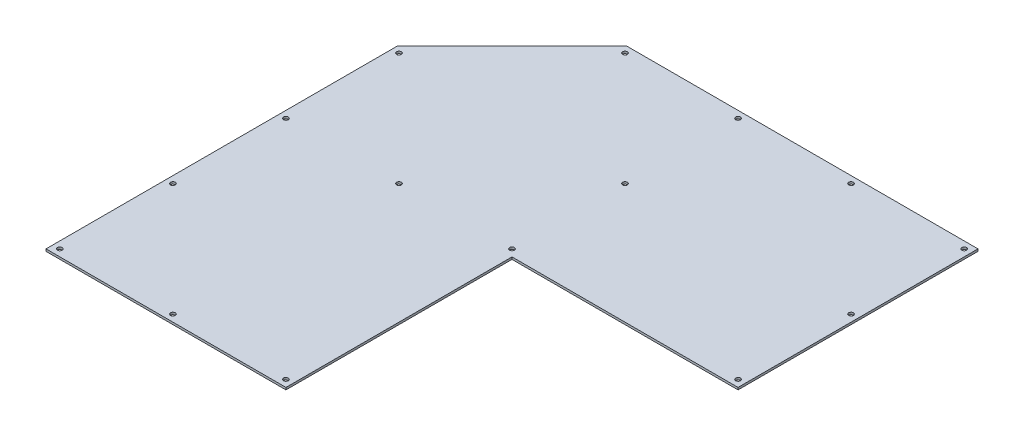
ISO-10303-21;
HEADER;
FILE_DESCRIPTION(('STEP AP214'),'2;1');
FILE_NAME('part.step','',(''),(''),'','','');
FILE_SCHEMA(('AUTOMOTIVE_DESIGN { 1 0 10303 214 1 1 1 1 }'));
ENDSEC;
DATA;
#1=APPLICATION_CONTEXT('core data for automotive mechanical design processes');
#2=APPLICATION_PROTOCOL_DEFINITION('international standard','automotive_design',2000,#1);
#3=PRODUCT_CONTEXT('',#1,'mechanical');
#4=PRODUCT('Part','Part','',(#3));
#5=PRODUCT_RELATED_PRODUCT_CATEGORY('part','',(#4));
#6=PRODUCT_DEFINITION_FORMATION('','',#4);
#7=PRODUCT_DEFINITION_CONTEXT('part definition',#1,'design');
#8=PRODUCT_DEFINITION('design','',#6,#7);
#9=PRODUCT_DEFINITION_SHAPE('','',#8);
#10=(LENGTH_UNIT() NAMED_UNIT(*) SI_UNIT(.MILLI.,.METRE.));
#11=(NAMED_UNIT(*) PLANE_ANGLE_UNIT() SI_UNIT($,.RADIAN.));
#12=(NAMED_UNIT(*) SI_UNIT($,.STERADIAN.) SOLID_ANGLE_UNIT());
#13=UNCERTAINTY_MEASURE_WITH_UNIT(LENGTH_MEASURE(1.E-05),#10,'distance_accuracy_value','');
#14=(GEOMETRIC_REPRESENTATION_CONTEXT(3) GLOBAL_UNCERTAINTY_ASSIGNED_CONTEXT((#13)) GLOBAL_UNIT_ASSIGNED_CONTEXT((#10,
#11,#12)) REPRESENTATION_CONTEXT('',''));
#15=CARTESIAN_POINT('',(0.,0.,0.));
#16=DIRECTION('',(0.,0.,1.));
#17=DIRECTION('',(1.,0.,0.));
#18=AXIS2_PLACEMENT_3D('',#15,#16,#17);
#19=CARTESIAN_POINT('',(175.26,-1.5875,0.));
#20=DIRECTION('',(0.,0.,1.));
#21=DIRECTION('',(1.,0.,0.));
#22=AXIS2_PLACEMENT_3D('',#19,#20,#21);
#23=PLANE('',#22);
#24=DIRECTION('',(1.,0.,0.));
#25=VECTOR('',#24,1.);
#26=CARTESIAN_POINT('',(175.26,0.,0.));
#27=LINE('',#26,#25);
#28=CARTESIAN_POINT('',(0.,0.,0.));
#29=VERTEX_POINT('',#28);
#30=CARTESIAN_POINT('',(175.26,0.,0.));
#31=VERTEX_POINT('',#30);
#32=EDGE_CURVE('E130',#29,#31,#27,.T.);
#33=ORIENTED_EDGE('',*,*,#32,.F.);
#34=DIRECTION('',(0.,1.,0.));
#35=VECTOR('',#34,1.);
#36=CARTESIAN_POINT('',(0.,-1.5875,0.));
#37=LINE('',#36,#35);
#38=CARTESIAN_POINT('',(0.,-1.5875,0.));
#39=VERTEX_POINT('',#38);
#40=EDGE_CURVE('E11',#39,#29,#37,.T.);
#41=ORIENTED_EDGE('',*,*,#40,.F.);
#42=DIRECTION('',(1.,0.,0.));
#43=VECTOR('',#42,1.);
#44=CARTESIAN_POINT('',(175.26,-1.5875,0.));
#45=LINE('',#44,#43);
#46=CARTESIAN_POINT('',(175.26,-1.5875,0.));
#47=VERTEX_POINT('',#46);
#48=EDGE_CURVE('E148',#39,#47,#45,.T.);
#49=ORIENTED_EDGE('',*,*,#48,.T.);
#50=DIRECTION('',(0.,1.,0.));
#51=VECTOR('',#50,1.);
#52=CARTESIAN_POINT('',(175.26,-1.5875,0.));
#53=LINE('',#52,#51);
#54=EDGE_CURVE('E42',#47,#31,#53,.T.);
#55=ORIENTED_EDGE('',*,*,#54,.T.);
#56=EDGE_LOOP('',(#33,#41,#49,#55));
#57=FACE_BOUND('',#56,.T.);
#58=ADVANCED_FACE('F39',(#57),#23,.T.);
#59=CARTESIAN_POINT('',(0.,-1.5875,0.));
#60=DIRECTION('',(-1.,0.,0.));
#61=DIRECTION('',(0.,0.,1.));
#62=AXIS2_PLACEMENT_3D('',#59,#60,#61);
#63=PLANE('',#62);
#64=DIRECTION('',(0.,0.,1.));
#65=VECTOR('',#64,1.);
#66=CARTESIAN_POINT('',(0.,0.,0.));
#67=LINE('',#66,#65);
#68=CARTESIAN_POINT('',(0.,0.,-256.54));
#69=VERTEX_POINT('',#68);
#70=EDGE_CURVE('E146',#69,#29,#67,.T.);
#71=ORIENTED_EDGE('',*,*,#70,.F.);
#72=DIRECTION('',(0.,1.,0.));
#73=VECTOR('',#72,1.);
#74=CARTESIAN_POINT('',(0.,-1.5875,-256.54));
#75=LINE('',#74,#73);
#76=CARTESIAN_POINT('',(0.,-1.5875,-256.54));
#77=VERTEX_POINT('',#76);
#78=EDGE_CURVE('E48',#77,#69,#75,.T.);
#79=ORIENTED_EDGE('',*,*,#78,.F.);
#80=DIRECTION('',(0.,0.,1.));
#81=VECTOR('',#80,1.);
#82=CARTESIAN_POINT('',(0.,-1.5875,0.));
#83=LINE('',#82,#81);
#84=EDGE_CURVE('E120',#77,#39,#83,.T.);
#85=ORIENTED_EDGE('',*,*,#84,.T.);
#86=ORIENTED_EDGE('',*,*,#40,.T.);
#87=EDGE_LOOP('',(#71,#79,#85,#86));
#88=FACE_BOUND('',#87,.T.);
#89=ADVANCED_FACE('F158',(#88),#63,.T.);
#90=CARTESIAN_POINT('',(0.,-1.5875,-256.54));
#91=DIRECTION('',(-0.707106781186548,0.,-0.707106781186548));
#92=DIRECTION('',(-0.707106781186548,0.,0.707106781186548));
#93=AXIS2_PLACEMENT_3D('',#90,#91,#92);
#94=PLANE('',#93);
#95=DIRECTION('',(-0.707106781186548,0.,0.707106781186548));
#96=VECTOR('',#95,1.);
#97=CARTESIAN_POINT('',(0.,0.,-256.54));
#98=LINE('',#97,#96);
#99=CARTESIAN_POINT('',(83.82,0.,-340.36));
#100=VERTEX_POINT('',#99);
#101=EDGE_CURVE('E107',#100,#69,#98,.T.);
#102=ORIENTED_EDGE('',*,*,#101,.F.);
#103=DIRECTION('',(0.,1.,0.));
#104=VECTOR('',#103,1.);
#105=CARTESIAN_POINT('',(83.82,-1.5875,-340.36));
#106=LINE('',#105,#104);
#107=CARTESIAN_POINT('',(83.82,-1.5875,-340.36));
#108=VERTEX_POINT('',#107);
#109=EDGE_CURVE('E102',#108,#100,#106,.T.);
#110=ORIENTED_EDGE('',*,*,#109,.F.);
#111=DIRECTION('',(-0.707106781186548,0.,0.707106781186548));
#112=VECTOR('',#111,1.);
#113=CARTESIAN_POINT('',(0.,-1.5875,-256.54));
#114=LINE('',#113,#112);
#115=EDGE_CURVE('E105',#108,#77,#114,.T.);
#116=ORIENTED_EDGE('',*,*,#115,.T.);
#117=ORIENTED_EDGE('',*,*,#78,.T.);
#118=EDGE_LOOP('',(#102,#110,#116,#117));
#119=FACE_BOUND('',#118,.T.);
#120=ADVANCED_FACE('F104',(#119),#94,.T.);
#121=CARTESIAN_POINT('',(83.82,-1.5875,-340.36));
#122=DIRECTION('',(0.,0.,-1.));
#123=DIRECTION('',(-1.,0.,0.));
#124=AXIS2_PLACEMENT_3D('',#121,#122,#123);
#125=PLANE('',#124);
#126=DIRECTION('',(-1.,0.,0.));
#127=VECTOR('',#126,1.);
#128=CARTESIAN_POINT('',(83.82,0.,-340.36));
#129=LINE('',#128,#127);
#130=CARTESIAN_POINT('',(340.36,0.,-340.36));
#131=VERTEX_POINT('',#130);
#132=EDGE_CURVE('E143',#131,#100,#129,.T.);
#133=ORIENTED_EDGE('',*,*,#132,.F.);
#134=DIRECTION('',(0.,1.,0.));
#135=VECTOR('',#134,1.);
#136=CARTESIAN_POINT('',(340.36,-1.5875,-340.36));
#137=LINE('',#136,#135);
#138=CARTESIAN_POINT('',(340.36,-1.5875,-340.36));
#139=VERTEX_POINT('',#138);
#140=EDGE_CURVE('E112',#139,#131,#137,.T.);
#141=ORIENTED_EDGE('',*,*,#140,.F.);
#142=DIRECTION('',(-1.,0.,0.));
#143=VECTOR('',#142,1.);
#144=CARTESIAN_POINT('',(83.82,-1.5875,-340.36));
#145=LINE('',#144,#143);
#146=EDGE_CURVE('E118',#139,#108,#145,.T.);
#147=ORIENTED_EDGE('',*,*,#146,.T.);
#148=ORIENTED_EDGE('',*,*,#109,.T.);
#149=EDGE_LOOP('',(#133,#141,#147,#148));
#150=FACE_BOUND('',#149,.T.);
#151=ADVANCED_FACE('F122',(#150),#125,.T.);
#152=CARTESIAN_POINT('',(340.36,-1.5875,-340.36));
#153=DIRECTION('',(1.,0.,0.));
#154=DIRECTION('',(0.,0.,-1.));
#155=AXIS2_PLACEMENT_3D('',#152,#153,#154);
#156=PLANE('',#155);
#157=DIRECTION('',(0.,0.,-1.));
#158=VECTOR('',#157,1.);
#159=CARTESIAN_POINT('',(340.36,0.,-340.36));
#160=LINE('',#159,#158);
#161=CARTESIAN_POINT('',(340.36,0.,-165.1));
#162=VERTEX_POINT('',#161);
#163=EDGE_CURVE('E140',#162,#131,#160,.T.);
#164=ORIENTED_EDGE('',*,*,#163,.F.);
#165=DIRECTION('',(0.,1.,0.));
#166=VECTOR('',#165,1.);
#167=CARTESIAN_POINT('',(340.36,-1.5875,-165.1));
#168=LINE('',#167,#166);
#169=CARTESIAN_POINT('',(340.36,-1.5875,-165.1));
#170=VERTEX_POINT('',#169);
#171=EDGE_CURVE('E152',#170,#162,#168,.T.);
#172=ORIENTED_EDGE('',*,*,#171,.F.);
#173=DIRECTION('',(0.,0.,-1.));
#174=VECTOR('',#173,1.);
#175=CARTESIAN_POINT('',(340.36,-1.5875,-340.36));
#176=LINE('',#175,#174);
#177=EDGE_CURVE('E123',#170,#139,#176,.T.);
#178=ORIENTED_EDGE('',*,*,#177,.T.);
#179=ORIENTED_EDGE('',*,*,#140,.T.);
#180=EDGE_LOOP('',(#164,#172,#178,#179));
#181=FACE_BOUND('',#180,.T.);
#182=ADVANCED_FACE('F171',(#181),#156,.T.);
#183=CARTESIAN_POINT('',(340.36,-1.5875,-165.1));
#184=DIRECTION('',(0.,0.,1.));
#185=DIRECTION('',(1.,0.,0.));
#186=AXIS2_PLACEMENT_3D('',#183,#184,#185);
#187=PLANE('',#186);
#188=DIRECTION('',(1.,0.,0.));
#189=VECTOR('',#188,1.);
#190=CARTESIAN_POINT('',(340.36,0.,-165.1));
#191=LINE('',#190,#189);
#192=CARTESIAN_POINT('',(175.26,0.,-165.1));
#193=VERTEX_POINT('',#192);
#194=EDGE_CURVE('E137',#193,#162,#191,.T.);
#195=ORIENTED_EDGE('',*,*,#194,.F.);
#196=DIRECTION('',(0.,1.,0.));
#197=VECTOR('',#196,1.);
#198=CARTESIAN_POINT('',(175.26,-1.5875,-165.1));
#199=LINE('',#198,#197);
#200=CARTESIAN_POINT('',(175.26,-1.5875,-165.1));
#201=VERTEX_POINT('',#200);
#202=EDGE_CURVE('E153',#201,#193,#199,.T.);
#203=ORIENTED_EDGE('',*,*,#202,.F.);
#204=DIRECTION('',(1.,0.,0.));
#205=VECTOR('',#204,1.);
#206=CARTESIAN_POINT('',(340.36,-1.5875,-165.1));
#207=LINE('',#206,#205);
#208=EDGE_CURVE('E125',#201,#170,#207,.T.);
#209=ORIENTED_EDGE('',*,*,#208,.T.);
#210=ORIENTED_EDGE('',*,*,#171,.T.);
#211=EDGE_LOOP('',(#195,#203,#209,#210));
#212=FACE_BOUND('',#211,.T.);
#213=ADVANCED_FACE('F174',(#212),#187,.T.);
#214=CARTESIAN_POINT('',(175.26,-1.5875,-165.1));
#215=DIRECTION('',(1.,0.,0.));
#216=DIRECTION('',(0.,0.,-1.));
#217=AXIS2_PLACEMENT_3D('',#214,#215,#216);
#218=PLANE('',#217);
#219=DIRECTION('',(0.,0.,-1.));
#220=VECTOR('',#219,1.);
#221=CARTESIAN_POINT('',(175.26,0.,-165.1));
#222=LINE('',#221,#220);
#223=EDGE_CURVE('E133',#31,#193,#222,.T.);
#224=ORIENTED_EDGE('',*,*,#223,.F.);
#225=ORIENTED_EDGE('',*,*,#54,.F.);
#226=DIRECTION('',(0.,0.,-1.));
#227=VECTOR('',#226,1.);
#228=CARTESIAN_POINT('',(175.26,-1.5875,-165.1));
#229=LINE('',#228,#227);
#230=EDGE_CURVE('E344',#47,#201,#229,.T.);
#231=ORIENTED_EDGE('',*,*,#230,.T.);
#232=ORIENTED_EDGE('',*,*,#202,.T.);
#233=EDGE_LOOP('',(#224,#225,#231,#232));
#234=FACE_BOUND('',#233,.T.);
#235=ADVANCED_FACE('F155',(#234),#218,.T.);
#236=CARTESIAN_POINT('',(0.,-1.5875,0.));
#237=DIRECTION('',(0.,-1.,0.));
#238=DIRECTION('',(0.,0.,-1.));
#239=AXIS2_PLACEMENT_3D('',#236,#237,#238);
#240=PLANE('',#239);
#241=CARTESIAN_POINT('',(5.08,-1.5875,-5.08));
#242=DIRECTION('',(0.,-1.,0.));
#243=DIRECTION('',(0.,0.,-1.));
#244=AXIS2_PLACEMENT_3D('',#241,#242,#243);
#245=CIRCLE('',#244,1.7272);
#246=CARTESIAN_POINT('',(5.08,-1.5875,-6.8072));
#247=VERTEX_POINT('',#246);
#248=EDGE_CURVE('E253',#247,#247,#245,.T.);
#249=ORIENTED_EDGE('',*,*,#248,.F.);
#250=EDGE_LOOP('',(#249));
#251=FACE_BOUND('',#250,.T.);
#252=CARTESIAN_POINT('',(335.28,-1.5875,-170.18));
#253=DIRECTION('',(0.,-1.,0.));
#254=DIRECTION('',(0.,0.,-1.));
#255=AXIS2_PLACEMENT_3D('',#252,#253,#254);
#256=CIRCLE('',#255,1.72719999999998);
#257=CARTESIAN_POINT('',(335.28,-1.5875,-171.9072));
#258=VERTEX_POINT('',#257);
#259=EDGE_CURVE('E263',#258,#258,#256,.T.);
#260=ORIENTED_EDGE('',*,*,#259,.F.);
#261=EDGE_LOOP('',(#260));
#262=FACE_BOUND('',#261,.T.);
#263=CARTESIAN_POINT('',(87.63,-1.5875,-5.08));
#264=DIRECTION('',(0.,-1.,0.));
#265=DIRECTION('',(0.,0.,-1.));
#266=AXIS2_PLACEMENT_3D('',#263,#264,#265);
#267=CIRCLE('',#266,1.7272);
#268=CARTESIAN_POINT('',(87.63,-1.5875,-6.8072));
#269=VERTEX_POINT('',#268);
#270=EDGE_CURVE('E269',#269,#269,#267,.T.);
#271=ORIENTED_EDGE('',*,*,#270,.F.);
#272=EDGE_LOOP('',(#271));
#273=FACE_BOUND('',#272,.T.);
#274=CARTESIAN_POINT('',(170.18,-1.5875,-5.08));
#275=DIRECTION('',(0.,-1.,0.));
#276=DIRECTION('',(0.,0.,-1.));
#277=AXIS2_PLACEMENT_3D('',#274,#275,#276);
#278=CIRCLE('',#277,1.72720000000001);
#279=CARTESIAN_POINT('',(170.18,-1.5875,-6.80720000000001));
#280=VERTEX_POINT('',#279);
#281=EDGE_CURVE('E275',#280,#280,#278,.T.);
#282=ORIENTED_EDGE('',*,*,#281,.F.);
#283=EDGE_LOOP('',(#282));
#284=FACE_BOUND('',#283,.T.);
#285=CARTESIAN_POINT('',(5.08,-1.5875,-87.63));
#286=DIRECTION('',(0.,-1.,0.));
#287=DIRECTION('',(0.,0.,-1.));
#288=AXIS2_PLACEMENT_3D('',#285,#286,#287);
#289=CIRCLE('',#288,1.7272);
#290=CARTESIAN_POINT('',(5.08,-1.5875,-89.3572));
#291=VERTEX_POINT('',#290);
#292=EDGE_CURVE('E281',#291,#291,#289,.T.);
#293=ORIENTED_EDGE('',*,*,#292,.F.);
#294=EDGE_LOOP('',(#293));
#295=FACE_BOUND('',#294,.T.);
#296=CARTESIAN_POINT('',(5.08,-1.5875,-170.18));
#297=DIRECTION('',(0.,-1.,0.));
#298=DIRECTION('',(0.,0.,-1.));
#299=AXIS2_PLACEMENT_3D('',#296,#297,#298);
#300=CIRCLE('',#299,1.7272);
#301=CARTESIAN_POINT('',(5.08,-1.5875,-171.9072));
#302=VERTEX_POINT('',#301);
#303=EDGE_CURVE('E287',#302,#302,#300,.T.);
#304=ORIENTED_EDGE('',*,*,#303,.F.);
#305=EDGE_LOOP('',(#304));
#306=FACE_BOUND('',#305,.T.);
#307=CARTESIAN_POINT('',(5.08,-1.5875,-252.73));
#308=DIRECTION('',(0.,-1.,0.));
#309=DIRECTION('',(0.,0.,-1.));
#310=AXIS2_PLACEMENT_3D('',#307,#308,#309);
#311=CIRCLE('',#310,1.7272);
#312=CARTESIAN_POINT('',(5.08,-1.5875,-254.4572));
#313=VERTEX_POINT('',#312);
#314=EDGE_CURVE('E293',#313,#313,#311,.T.);
#315=ORIENTED_EDGE('',*,*,#314,.F.);
#316=EDGE_LOOP('',(#315));
#317=FACE_BOUND('',#316,.T.);
#318=CARTESIAN_POINT('',(335.28,-1.5875,-252.73));
#319=DIRECTION('',(0.,-1.,0.));
#320=DIRECTION('',(0.,0.,-1.));
#321=AXIS2_PLACEMENT_3D('',#318,#319,#320);
#322=CIRCLE('',#321,1.72719999999998);
#323=CARTESIAN_POINT('',(335.28,-1.5875,-254.4572));
#324=VERTEX_POINT('',#323);
#325=EDGE_CURVE('E299',#324,#324,#322,.T.);
#326=ORIENTED_EDGE('',*,*,#325,.F.);
#327=EDGE_LOOP('',(#326));
#328=FACE_BOUND('',#327,.T.);
#329=CARTESIAN_POINT('',(335.28,-1.5875,-335.28));
#330=DIRECTION('',(0.,-1.,0.));
#331=DIRECTION('',(0.,0.,-1.));
#332=AXIS2_PLACEMENT_3D('',#329,#330,#331);
#333=CIRCLE('',#332,1.72719999999998);
#334=CARTESIAN_POINT('',(335.28,-1.5875,-337.0072));
#335=VERTEX_POINT('',#334);
#336=EDGE_CURVE('E305',#335,#335,#333,.T.);
#337=ORIENTED_EDGE('',*,*,#336,.F.);
#338=EDGE_LOOP('',(#337));
#339=FACE_BOUND('',#338,.T.);
#340=CARTESIAN_POINT('',(252.73,-1.5875,-335.28));
#341=DIRECTION('',(0.,-1.,0.));
#342=DIRECTION('',(0.,0.,-1.));
#343=AXIS2_PLACEMENT_3D('',#340,#341,#342);
#344=CIRCLE('',#343,1.72719999999998);
#345=CARTESIAN_POINT('',(252.73,-1.5875,-337.0072));
#346=VERTEX_POINT('',#345);
#347=EDGE_CURVE('E311',#346,#346,#344,.T.);
#348=ORIENTED_EDGE('',*,*,#347,.F.);
#349=EDGE_LOOP('',(#348));
#350=FACE_BOUND('',#349,.T.);
#351=CARTESIAN_POINT('',(170.18,-1.5875,-335.28));
#352=DIRECTION('',(0.,-1.,0.));
#353=DIRECTION('',(0.,0.,-1.));
#354=AXIS2_PLACEMENT_3D('',#351,#352,#353);
#355=CIRCLE('',#354,1.72720000000001);
#356=CARTESIAN_POINT('',(170.18,-1.5875,-337.0072));
#357=VERTEX_POINT('',#356);
#358=EDGE_CURVE('E317',#357,#357,#355,.T.);
#359=ORIENTED_EDGE('',*,*,#358,.F.);
#360=EDGE_LOOP('',(#359));
#361=FACE_BOUND('',#360,.T.);
#362=CARTESIAN_POINT('',(87.63,-1.5875,-335.28));
#363=DIRECTION('',(0.,-1.,0.));
#364=DIRECTION('',(0.,0.,-1.));
#365=AXIS2_PLACEMENT_3D('',#362,#363,#364);
#366=CIRCLE('',#365,1.7272);
#367=CARTESIAN_POINT('',(87.63,-1.5875,-337.0072));
#368=VERTEX_POINT('',#367);
#369=EDGE_CURVE('E323',#368,#368,#366,.T.);
#370=ORIENTED_EDGE('',*,*,#369,.F.);
#371=EDGE_LOOP('',(#370));
#372=FACE_BOUND('',#371,.T.);
#373=CARTESIAN_POINT('',(170.18,-1.5875,-170.18));
#374=DIRECTION('',(0.,-1.,0.));
#375=DIRECTION('',(0.,0.,-1.));
#376=AXIS2_PLACEMENT_3D('',#373,#374,#375);
#377=CIRCLE('',#376,1.72720000000001);
#378=CARTESIAN_POINT('',(170.18,-1.5875,-171.9072));
#379=VERTEX_POINT('',#378);
#380=EDGE_CURVE('E329',#379,#379,#377,.T.);
#381=ORIENTED_EDGE('',*,*,#380,.F.);
#382=EDGE_LOOP('',(#381));
#383=FACE_BOUND('',#382,.T.);
#384=CARTESIAN_POINT('',(87.63,-1.5875,-170.18));
#385=DIRECTION('',(0.,-1.,0.));
#386=DIRECTION('',(0.,0.,-1.));
#387=AXIS2_PLACEMENT_3D('',#384,#385,#386);
#388=CIRCLE('',#387,1.7272);
#389=CARTESIAN_POINT('',(87.63,-1.5875,-171.9072));
#390=VERTEX_POINT('',#389);
#391=EDGE_CURVE('E335',#390,#390,#388,.T.);
#392=ORIENTED_EDGE('',*,*,#391,.F.);
#393=EDGE_LOOP('',(#392));
#394=FACE_BOUND('',#393,.T.);
#395=CARTESIAN_POINT('',(170.18,-1.5875,-252.73));
#396=DIRECTION('',(0.,-1.,0.));
#397=DIRECTION('',(0.,0.,-1.));
#398=AXIS2_PLACEMENT_3D('',#395,#396,#397);
#399=CIRCLE('',#398,1.72720000000001);
#400=CARTESIAN_POINT('',(170.18,-1.5875,-254.4572));
#401=VERTEX_POINT('',#400);
#402=EDGE_CURVE('E134',#401,#401,#399,.T.);
#403=ORIENTED_EDGE('',*,*,#402,.F.);
#404=EDGE_LOOP('',(#403));
#405=FACE_BOUND('',#404,.T.);
#406=ORIENTED_EDGE('',*,*,#48,.F.);
#407=ORIENTED_EDGE('',*,*,#84,.F.);
#408=ORIENTED_EDGE('',*,*,#115,.F.);
#409=ORIENTED_EDGE('',*,*,#146,.F.);
#410=ORIENTED_EDGE('',*,*,#177,.F.);
#411=ORIENTED_EDGE('',*,*,#208,.F.);
#412=ORIENTED_EDGE('',*,*,#230,.F.);
#413=EDGE_LOOP('',(#406,#407,#408,#409,#410,#411,#412));
#414=FACE_BOUND('',#413,.T.);
#415=ADVANCED_FACE('F116',(#251,#262,#273,#284,#295,#306,#317,#328,#339,#350,#361,#372,#383,
#394,#405,#414),#240,.T.);
#416=CARTESIAN_POINT('',(0.,0.,0.));
#417=DIRECTION('',(0.,-1.,0.));
#418=DIRECTION('',(0.,0.,-1.));
#419=AXIS2_PLACEMENT_3D('',#416,#417,#418);
#420=PLANE('',#419);
#421=CARTESIAN_POINT('',(5.08,0.,-5.08));
#422=DIRECTION('',(0.,1.,0.));
#423=DIRECTION('',(0.,0.,1.));
#424=AXIS2_PLACEMENT_3D('',#421,#422,#423);
#425=CIRCLE('',#424,1.7272);
#426=CARTESIAN_POINT('',(5.08,0.,-3.3528));
#427=VERTEX_POINT('',#426);
#428=EDGE_CURVE('E256',#427,#427,#425,.T.);
#429=ORIENTED_EDGE('',*,*,#428,.F.);
#430=EDGE_LOOP('',(#429));
#431=FACE_BOUND('',#430,.T.);
#432=CARTESIAN_POINT('',(335.28,0.,-170.18));
#433=DIRECTION('',(0.,1.,0.));
#434=DIRECTION('',(0.,0.,1.));
#435=AXIS2_PLACEMENT_3D('',#432,#433,#434);
#436=CIRCLE('',#435,1.72719999999998);
#437=CARTESIAN_POINT('',(335.28,0.,-168.4528));
#438=VERTEX_POINT('',#437);
#439=EDGE_CURVE('E258',#438,#438,#436,.T.);
#440=ORIENTED_EDGE('',*,*,#439,.F.);
#441=EDGE_LOOP('',(#440));
#442=FACE_BOUND('',#441,.T.);
#443=CARTESIAN_POINT('',(87.63,0.,-5.08));
#444=DIRECTION('',(0.,1.,0.));
#445=DIRECTION('',(0.,0.,1.));
#446=AXIS2_PLACEMENT_3D('',#443,#444,#445);
#447=CIRCLE('',#446,1.7272);
#448=CARTESIAN_POINT('',(87.63,0.,-3.3528));
#449=VERTEX_POINT('',#448);
#450=EDGE_CURVE('E266',#449,#449,#447,.T.);
#451=ORIENTED_EDGE('',*,*,#450,.F.);
#452=EDGE_LOOP('',(#451));
#453=FACE_BOUND('',#452,.T.);
#454=CARTESIAN_POINT('',(170.18,0.,-5.08));
#455=DIRECTION('',(0.,1.,0.));
#456=DIRECTION('',(0.,0.,1.));
#457=AXIS2_PLACEMENT_3D('',#454,#455,#456);
#458=CIRCLE('',#457,1.72720000000001);
#459=CARTESIAN_POINT('',(170.18,0.,-3.35279999999999));
#460=VERTEX_POINT('',#459);
#461=EDGE_CURVE('E272',#460,#460,#458,.T.);
#462=ORIENTED_EDGE('',*,*,#461,.F.);
#463=EDGE_LOOP('',(#462));
#464=FACE_BOUND('',#463,.T.);
#465=CARTESIAN_POINT('',(5.08,0.,-87.63));
#466=DIRECTION('',(0.,1.,0.));
#467=DIRECTION('',(0.,0.,1.));
#468=AXIS2_PLACEMENT_3D('',#465,#466,#467);
#469=CIRCLE('',#468,1.7272);
#470=CARTESIAN_POINT('',(5.08,0.,-85.9028));
#471=VERTEX_POINT('',#470);
#472=EDGE_CURVE('E278',#471,#471,#469,.T.);
#473=ORIENTED_EDGE('',*,*,#472,.F.);
#474=EDGE_LOOP('',(#473));
#475=FACE_BOUND('',#474,.T.);
#476=CARTESIAN_POINT('',(5.08,0.,-170.18));
#477=DIRECTION('',(0.,1.,0.));
#478=DIRECTION('',(0.,0.,1.));
#479=AXIS2_PLACEMENT_3D('',#476,#477,#478);
#480=CIRCLE('',#479,1.7272);
#481=CARTESIAN_POINT('',(5.08,0.,-168.4528));
#482=VERTEX_POINT('',#481);
#483=EDGE_CURVE('E284',#482,#482,#480,.T.);
#484=ORIENTED_EDGE('',*,*,#483,.F.);
#485=EDGE_LOOP('',(#484));
#486=FACE_BOUND('',#485,.T.);
#487=CARTESIAN_POINT('',(5.08,0.,-252.73));
#488=DIRECTION('',(0.,1.,0.));
#489=DIRECTION('',(0.,0.,1.));
#490=AXIS2_PLACEMENT_3D('',#487,#488,#489);
#491=CIRCLE('',#490,1.7272);
#492=CARTESIAN_POINT('',(5.08,0.,-251.0028));
#493=VERTEX_POINT('',#492);
#494=EDGE_CURVE('E290',#493,#493,#491,.T.);
#495=ORIENTED_EDGE('',*,*,#494,.F.);
#496=EDGE_LOOP('',(#495));
#497=FACE_BOUND('',#496,.T.);
#498=CARTESIAN_POINT('',(335.28,0.,-252.73));
#499=DIRECTION('',(0.,1.,0.));
#500=DIRECTION('',(0.,0.,1.));
#501=AXIS2_PLACEMENT_3D('',#498,#499,#500);
#502=CIRCLE('',#501,1.72719999999998);
#503=CARTESIAN_POINT('',(335.28,0.,-251.0028));
#504=VERTEX_POINT('',#503);
#505=EDGE_CURVE('E296',#504,#504,#502,.T.);
#506=ORIENTED_EDGE('',*,*,#505,.F.);
#507=EDGE_LOOP('',(#506));
#508=FACE_BOUND('',#507,.T.);
#509=CARTESIAN_POINT('',(335.28,0.,-335.28));
#510=DIRECTION('',(0.,1.,0.));
#511=DIRECTION('',(0.,0.,1.));
#512=AXIS2_PLACEMENT_3D('',#509,#510,#511);
#513=CIRCLE('',#512,1.72719999999998);
#514=CARTESIAN_POINT('',(335.28,0.,-333.5528));
#515=VERTEX_POINT('',#514);
#516=EDGE_CURVE('E302',#515,#515,#513,.T.);
#517=ORIENTED_EDGE('',*,*,#516,.F.);
#518=EDGE_LOOP('',(#517));
#519=FACE_BOUND('',#518,.T.);
#520=CARTESIAN_POINT('',(252.73,0.,-335.28));
#521=DIRECTION('',(0.,1.,0.));
#522=DIRECTION('',(0.,0.,1.));
#523=AXIS2_PLACEMENT_3D('',#520,#521,#522);
#524=CIRCLE('',#523,1.72719999999998);
#525=CARTESIAN_POINT('',(252.73,0.,-333.5528));
#526=VERTEX_POINT('',#525);
#527=EDGE_CURVE('E308',#526,#526,#524,.T.);
#528=ORIENTED_EDGE('',*,*,#527,.F.);
#529=EDGE_LOOP('',(#528));
#530=FACE_BOUND('',#529,.T.);
#531=CARTESIAN_POINT('',(170.18,0.,-335.28));
#532=DIRECTION('',(0.,1.,0.));
#533=DIRECTION('',(0.,0.,1.));
#534=AXIS2_PLACEMENT_3D('',#531,#532,#533);
#535=CIRCLE('',#534,1.72720000000001);
#536=CARTESIAN_POINT('',(170.18,0.,-333.5528));
#537=VERTEX_POINT('',#536);
#538=EDGE_CURVE('E314',#537,#537,#535,.T.);
#539=ORIENTED_EDGE('',*,*,#538,.F.);
#540=EDGE_LOOP('',(#539));
#541=FACE_BOUND('',#540,.T.);
#542=CARTESIAN_POINT('',(87.63,0.,-335.28));
#543=DIRECTION('',(0.,1.,0.));
#544=DIRECTION('',(0.,0.,1.));
#545=AXIS2_PLACEMENT_3D('',#542,#543,#544);
#546=CIRCLE('',#545,1.7272);
#547=CARTESIAN_POINT('',(87.63,0.,-333.5528));
#548=VERTEX_POINT('',#547);
#549=EDGE_CURVE('E320',#548,#548,#546,.T.);
#550=ORIENTED_EDGE('',*,*,#549,.F.);
#551=EDGE_LOOP('',(#550));
#552=FACE_BOUND('',#551,.T.);
#553=CARTESIAN_POINT('',(170.18,0.,-170.18));
#554=DIRECTION('',(0.,1.,0.));
#555=DIRECTION('',(0.,0.,1.));
#556=AXIS2_PLACEMENT_3D('',#553,#554,#555);
#557=CIRCLE('',#556,1.72720000000001);
#558=CARTESIAN_POINT('',(170.18,0.,-168.4528));
#559=VERTEX_POINT('',#558);
#560=EDGE_CURVE('E326',#559,#559,#557,.T.);
#561=ORIENTED_EDGE('',*,*,#560,.F.);
#562=EDGE_LOOP('',(#561));
#563=FACE_BOUND('',#562,.T.);
#564=CARTESIAN_POINT('',(87.63,0.,-170.18));
#565=DIRECTION('',(0.,1.,0.));
#566=DIRECTION('',(0.,0.,1.));
#567=AXIS2_PLACEMENT_3D('',#564,#565,#566);
#568=CIRCLE('',#567,1.7272);
#569=CARTESIAN_POINT('',(87.63,0.,-168.4528));
#570=VERTEX_POINT('',#569);
#571=EDGE_CURVE('E332',#570,#570,#568,.T.);
#572=ORIENTED_EDGE('',*,*,#571,.F.);
#573=EDGE_LOOP('',(#572));
#574=FACE_BOUND('',#573,.T.);
#575=CARTESIAN_POINT('',(170.18,0.,-252.73));
#576=DIRECTION('',(0.,1.,0.));
#577=DIRECTION('',(0.,0.,1.));
#578=AXIS2_PLACEMENT_3D('',#575,#576,#577);
#579=CIRCLE('',#578,1.72720000000001);
#580=CARTESIAN_POINT('',(170.18,0.,-251.0028));
#581=VERTEX_POINT('',#580);
#582=EDGE_CURVE('E338',#581,#581,#579,.T.);
#583=ORIENTED_EDGE('',*,*,#582,.F.);
#584=EDGE_LOOP('',(#583));
#585=FACE_BOUND('',#584,.T.);
#586=ORIENTED_EDGE('',*,*,#32,.T.);
#587=ORIENTED_EDGE('',*,*,#223,.T.);
#588=ORIENTED_EDGE('',*,*,#194,.T.);
#589=ORIENTED_EDGE('',*,*,#163,.T.);
#590=ORIENTED_EDGE('',*,*,#132,.T.);
#591=ORIENTED_EDGE('',*,*,#101,.T.);
#592=ORIENTED_EDGE('',*,*,#70,.T.);
#593=EDGE_LOOP('',(#586,#587,#588,#589,#590,#591,#592));
#594=FACE_BOUND('',#593,.T.);
#595=ADVANCED_FACE('F157',(#431,#442,#453,#464,#475,#486,#497,#508,#519,#530,#541,#552,#563,
#574,#585,#594),#420,.F.);
#596=CARTESIAN_POINT('',(170.18,0.,-252.73));
#597=DIRECTION('',(0.,1.,0.));
#598=DIRECTION('',(0.,0.,1.));
#599=AXIS2_PLACEMENT_3D('',#596,#597,#598);
#600=CYLINDRICAL_SURFACE('',#599,1.72720000000001);
#601=ORIENTED_EDGE('',*,*,#402,.T.);
#602=EDGE_LOOP('',(#601));
#603=FACE_BOUND('',#602,.T.);
#604=ORIENTED_EDGE('',*,*,#582,.T.);
#605=EDGE_LOOP('',(#604));
#606=FACE_BOUND('',#605,.T.);
#607=ADVANCED_FACE('F186',(#603,#606),#600,.F.);
#608=CARTESIAN_POINT('',(87.63,0.,-170.18));
#609=DIRECTION('',(0.,1.,0.));
#610=DIRECTION('',(0.,0.,1.));
#611=AXIS2_PLACEMENT_3D('',#608,#609,#610);
#612=CYLINDRICAL_SURFACE('',#611,1.7272);
#613=ORIENTED_EDGE('',*,*,#391,.T.);
#614=EDGE_LOOP('',(#613));
#615=FACE_BOUND('',#614,.T.);
#616=ORIENTED_EDGE('',*,*,#571,.T.);
#617=EDGE_LOOP('',(#616));
#618=FACE_BOUND('',#617,.T.);
#619=ADVANCED_FACE('F193',(#615,#618),#612,.F.);
#620=CARTESIAN_POINT('',(170.18,0.,-170.18));
#621=DIRECTION('',(0.,1.,0.));
#622=DIRECTION('',(0.,0.,1.));
#623=AXIS2_PLACEMENT_3D('',#620,#621,#622);
#624=CYLINDRICAL_SURFACE('',#623,1.72720000000001);
#625=ORIENTED_EDGE('',*,*,#380,.T.);
#626=EDGE_LOOP('',(#625));
#627=FACE_BOUND('',#626,.T.);
#628=ORIENTED_EDGE('',*,*,#560,.T.);
#629=EDGE_LOOP('',(#628));
#630=FACE_BOUND('',#629,.T.);
#631=ADVANCED_FACE('F197',(#627,#630),#624,.F.);
#632=CARTESIAN_POINT('',(87.63,0.,-335.28));
#633=DIRECTION('',(0.,1.,0.));
#634=DIRECTION('',(0.,0.,1.));
#635=AXIS2_PLACEMENT_3D('',#632,#633,#634);
#636=CYLINDRICAL_SURFACE('',#635,1.7272);
#637=ORIENTED_EDGE('',*,*,#369,.T.);
#638=EDGE_LOOP('',(#637));
#639=FACE_BOUND('',#638,.T.);
#640=ORIENTED_EDGE('',*,*,#549,.T.);
#641=EDGE_LOOP('',(#640));
#642=FACE_BOUND('',#641,.T.);
#643=ADVANCED_FACE('F201',(#639,#642),#636,.F.);
#644=CARTESIAN_POINT('',(170.18,0.,-335.28));
#645=DIRECTION('',(0.,1.,0.));
#646=DIRECTION('',(0.,0.,1.));
#647=AXIS2_PLACEMENT_3D('',#644,#645,#646);
#648=CYLINDRICAL_SURFACE('',#647,1.72720000000001);
#649=ORIENTED_EDGE('',*,*,#358,.T.);
#650=EDGE_LOOP('',(#649));
#651=FACE_BOUND('',#650,.T.);
#652=ORIENTED_EDGE('',*,*,#538,.T.);
#653=EDGE_LOOP('',(#652));
#654=FACE_BOUND('',#653,.T.);
#655=ADVANCED_FACE('F205',(#651,#654),#648,.F.);
#656=CARTESIAN_POINT('',(252.73,0.,-335.28));
#657=DIRECTION('',(0.,1.,0.));
#658=DIRECTION('',(0.,0.,1.));
#659=AXIS2_PLACEMENT_3D('',#656,#657,#658);
#660=CYLINDRICAL_SURFACE('',#659,1.72719999999998);
#661=ORIENTED_EDGE('',*,*,#347,.T.);
#662=EDGE_LOOP('',(#661));
#663=FACE_BOUND('',#662,.T.);
#664=ORIENTED_EDGE('',*,*,#527,.T.);
#665=EDGE_LOOP('',(#664));
#666=FACE_BOUND('',#665,.T.);
#667=ADVANCED_FACE('F209',(#663,#666),#660,.F.);
#668=CARTESIAN_POINT('',(335.28,0.,-335.28));
#669=DIRECTION('',(0.,1.,0.));
#670=DIRECTION('',(0.,0.,1.));
#671=AXIS2_PLACEMENT_3D('',#668,#669,#670);
#672=CYLINDRICAL_SURFACE('',#671,1.72719999999998);
#673=ORIENTED_EDGE('',*,*,#336,.T.);
#674=EDGE_LOOP('',(#673));
#675=FACE_BOUND('',#674,.T.);
#676=ORIENTED_EDGE('',*,*,#516,.T.);
#677=EDGE_LOOP('',(#676));
#678=FACE_BOUND('',#677,.T.);
#679=ADVANCED_FACE('F213',(#675,#678),#672,.F.);
#680=CARTESIAN_POINT('',(335.28,0.,-252.73));
#681=DIRECTION('',(0.,1.,0.));
#682=DIRECTION('',(0.,0.,1.));
#683=AXIS2_PLACEMENT_3D('',#680,#681,#682);
#684=CYLINDRICAL_SURFACE('',#683,1.72719999999998);
#685=ORIENTED_EDGE('',*,*,#325,.T.);
#686=EDGE_LOOP('',(#685));
#687=FACE_BOUND('',#686,.T.);
#688=ORIENTED_EDGE('',*,*,#505,.T.);
#689=EDGE_LOOP('',(#688));
#690=FACE_BOUND('',#689,.T.);
#691=ADVANCED_FACE('F217',(#687,#690),#684,.F.);
#692=CARTESIAN_POINT('',(5.08,0.,-252.73));
#693=DIRECTION('',(0.,1.,0.));
#694=DIRECTION('',(0.,0.,1.));
#695=AXIS2_PLACEMENT_3D('',#692,#693,#694);
#696=CYLINDRICAL_SURFACE('',#695,1.7272);
#697=ORIENTED_EDGE('',*,*,#314,.T.);
#698=EDGE_LOOP('',(#697));
#699=FACE_BOUND('',#698,.T.);
#700=ORIENTED_EDGE('',*,*,#494,.T.);
#701=EDGE_LOOP('',(#700));
#702=FACE_BOUND('',#701,.T.);
#703=ADVANCED_FACE('F221',(#699,#702),#696,.F.);
#704=CARTESIAN_POINT('',(5.08,0.,-170.18));
#705=DIRECTION('',(0.,1.,0.));
#706=DIRECTION('',(0.,0.,1.));
#707=AXIS2_PLACEMENT_3D('',#704,#705,#706);
#708=CYLINDRICAL_SURFACE('',#707,1.7272);
#709=ORIENTED_EDGE('',*,*,#303,.T.);
#710=EDGE_LOOP('',(#709));
#711=FACE_BOUND('',#710,.T.);
#712=ORIENTED_EDGE('',*,*,#483,.T.);
#713=EDGE_LOOP('',(#712));
#714=FACE_BOUND('',#713,.T.);
#715=ADVANCED_FACE('F225',(#711,#714),#708,.F.);
#716=CARTESIAN_POINT('',(5.08,0.,-87.63));
#717=DIRECTION('',(0.,1.,0.));
#718=DIRECTION('',(0.,0.,1.));
#719=AXIS2_PLACEMENT_3D('',#716,#717,#718);
#720=CYLINDRICAL_SURFACE('',#719,1.7272);
#721=ORIENTED_EDGE('',*,*,#292,.T.);
#722=EDGE_LOOP('',(#721));
#723=FACE_BOUND('',#722,.T.);
#724=ORIENTED_EDGE('',*,*,#472,.T.);
#725=EDGE_LOOP('',(#724));
#726=FACE_BOUND('',#725,.T.);
#727=ADVANCED_FACE('F229',(#723,#726),#720,.F.);
#728=CARTESIAN_POINT('',(170.18,0.,-5.08));
#729=DIRECTION('',(0.,1.,0.));
#730=DIRECTION('',(0.,0.,1.));
#731=AXIS2_PLACEMENT_3D('',#728,#729,#730);
#732=CYLINDRICAL_SURFACE('',#731,1.72720000000001);
#733=ORIENTED_EDGE('',*,*,#281,.T.);
#734=EDGE_LOOP('',(#733));
#735=FACE_BOUND('',#734,.T.);
#736=ORIENTED_EDGE('',*,*,#461,.T.);
#737=EDGE_LOOP('',(#736));
#738=FACE_BOUND('',#737,.T.);
#739=ADVANCED_FACE('F233',(#735,#738),#732,.F.);
#740=CARTESIAN_POINT('',(87.63,0.,-5.08));
#741=DIRECTION('',(0.,1.,0.));
#742=DIRECTION('',(0.,0.,1.));
#743=AXIS2_PLACEMENT_3D('',#740,#741,#742);
#744=CYLINDRICAL_SURFACE('',#743,1.7272);
#745=ORIENTED_EDGE('',*,*,#270,.T.);
#746=EDGE_LOOP('',(#745));
#747=FACE_BOUND('',#746,.T.);
#748=ORIENTED_EDGE('',*,*,#450,.T.);
#749=EDGE_LOOP('',(#748));
#750=FACE_BOUND('',#749,.T.);
#751=ADVANCED_FACE('F237',(#747,#750),#744,.F.);
#752=CARTESIAN_POINT('',(335.28,0.,-170.18));
#753=DIRECTION('',(0.,1.,0.));
#754=DIRECTION('',(0.,0.,1.));
#755=AXIS2_PLACEMENT_3D('',#752,#753,#754);
#756=CYLINDRICAL_SURFACE('',#755,1.72719999999998);
#757=ORIENTED_EDGE('',*,*,#259,.T.);
#758=EDGE_LOOP('',(#757));
#759=FACE_BOUND('',#758,.T.);
#760=ORIENTED_EDGE('',*,*,#439,.T.);
#761=EDGE_LOOP('',(#760));
#762=FACE_BOUND('',#761,.T.);
#763=ADVANCED_FACE('F241',(#759,#762),#756,.F.);
#764=CARTESIAN_POINT('',(5.08,0.,-5.08));
#765=DIRECTION('',(0.,1.,0.));
#766=DIRECTION('',(0.,0.,1.));
#767=AXIS2_PLACEMENT_3D('',#764,#765,#766);
#768=CYLINDRICAL_SURFACE('',#767,1.7272);
#769=ORIENTED_EDGE('',*,*,#248,.T.);
#770=EDGE_LOOP('',(#769));
#771=FACE_BOUND('',#770,.T.);
#772=ORIENTED_EDGE('',*,*,#428,.T.);
#773=EDGE_LOOP('',(#772));
#774=FACE_BOUND('',#773,.T.);
#775=ADVANCED_FACE('F245',(#771,#774),#768,.F.);
#776=CLOSED_SHELL('',(#58,#89,#120,#151,#182,#213,#235,#415,#595,#607,#619,#631,#643,#655,#667,
#679,#691,#703,#715,#727,#739,#751,#763,#775));
#777=MANIFOLD_SOLID_BREP('B2',#776);
#778=ADVANCED_BREP_SHAPE_REPRESENTATION('',(#18,#777),#14);
#779=SHAPE_DEFINITION_REPRESENTATION(#9,#778);
ENDSEC;
END-ISO-10303-21;
